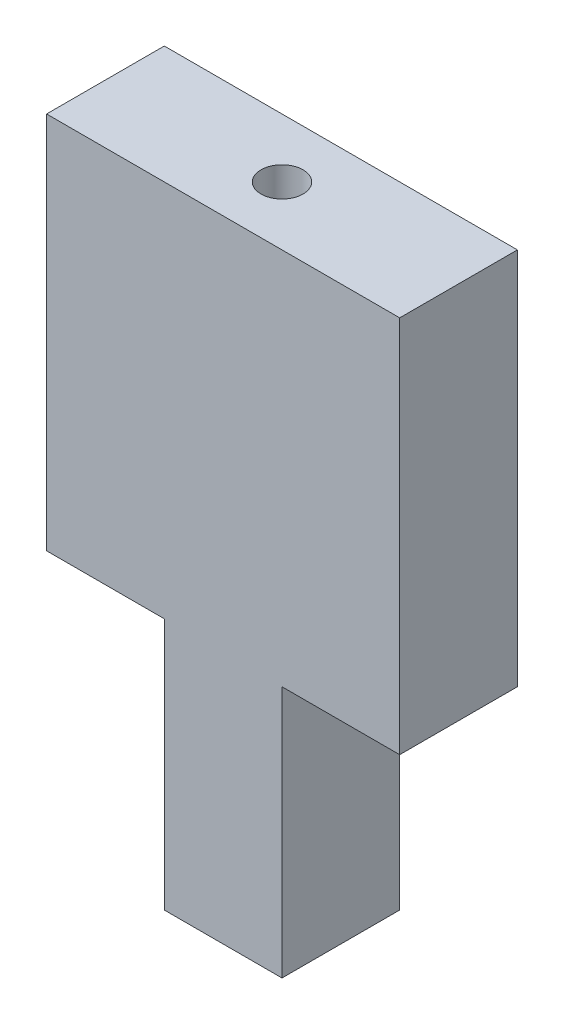
ISO-10303-21;
HEADER;
FILE_DESCRIPTION(('STEP AP214'),'2;1');
FILE_NAME('part.step','',(''),(''),'','','');
FILE_SCHEMA(('AUTOMOTIVE_DESIGN { 1 0 10303 214 1 1 1 1 }'));
ENDSEC;
DATA;
#1=APPLICATION_CONTEXT('core data for automotive mechanical design processes');
#2=APPLICATION_PROTOCOL_DEFINITION('international standard','automotive_design',2000,#1);
#3=PRODUCT_CONTEXT('',#1,'mechanical');
#4=PRODUCT('Part','Part','',(#3));
#5=PRODUCT_RELATED_PRODUCT_CATEGORY('part','',(#4));
#6=PRODUCT_DEFINITION_FORMATION('','',#4);
#7=PRODUCT_DEFINITION_CONTEXT('part definition',#1,'design');
#8=PRODUCT_DEFINITION('design','',#6,#7);
#9=PRODUCT_DEFINITION_SHAPE('','',#8);
#10=(LENGTH_UNIT() NAMED_UNIT(*) SI_UNIT(.MILLI.,.METRE.));
#11=(NAMED_UNIT(*) PLANE_ANGLE_UNIT() SI_UNIT($,.RADIAN.));
#12=(NAMED_UNIT(*) SI_UNIT($,.STERADIAN.) SOLID_ANGLE_UNIT());
#13=UNCERTAINTY_MEASURE_WITH_UNIT(LENGTH_MEASURE(1.E-05),#10,'distance_accuracy_value','');
#14=(GEOMETRIC_REPRESENTATION_CONTEXT(3) GLOBAL_UNCERTAINTY_ASSIGNED_CONTEXT((#13)) GLOBAL_UNIT_ASSIGNED_CONTEXT((#10,
#11,#12)) REPRESENTATION_CONTEXT('',''));
#15=CARTESIAN_POINT('',(0.,0.,0.));
#16=DIRECTION('',(0.,0.,1.));
#17=DIRECTION('',(1.,0.,0.));
#18=AXIS2_PLACEMENT_3D('',#15,#16,#17);
#19=CARTESIAN_POINT('',(-7.,75.,7.));
#20=DIRECTION('',(1.,0.,0.));
#21=DIRECTION('',(0.,0.,-1.));
#22=AXIS2_PLACEMENT_3D('',#19,#20,#21);
#23=PLANE('',#22);
#24=DIRECTION('',(0.,0.,1.));
#25=VECTOR('',#24,1.);
#26=CARTESIAN_POINT('',(-7.,30.,-6.99999999999999));
#27=LINE('',#26,#25);
#28=CARTESIAN_POINT('',(-7.,30.,-7.));
#29=VERTEX_POINT('',#28);
#30=CARTESIAN_POINT('',(-7.,30.,7.));
#31=VERTEX_POINT('',#30);
#32=EDGE_CURVE('E50',#29,#31,#27,.T.);
#33=ORIENTED_EDGE('',*,*,#32,.F.);
#34=DIRECTION('',(0.,-1.,0.));
#35=VECTOR('',#34,1.);
#36=CARTESIAN_POINT('',(-7.,75.,-7.));
#37=LINE('',#36,#35);
#38=CARTESIAN_POINT('',(-7.,0.,-7.));
#39=VERTEX_POINT('',#38);
#40=EDGE_CURVE('E43',#29,#39,#37,.T.);
#41=ORIENTED_EDGE('',*,*,#40,.T.);
#42=DIRECTION('',(0.,0.,1.));
#43=VECTOR('',#42,1.);
#44=CARTESIAN_POINT('',(-7.,0.,7.));
#45=LINE('',#44,#43);
#46=CARTESIAN_POINT('',(-7.,0.,7.));
#47=VERTEX_POINT('',#46);
#48=EDGE_CURVE('E160',#39,#47,#45,.T.);
#49=ORIENTED_EDGE('',*,*,#48,.T.);
#50=DIRECTION('',(0.,-1.,0.));
#51=VECTOR('',#50,1.);
#52=CARTESIAN_POINT('',(-7.,75.,7.));
#53=LINE('',#52,#51);
#54=EDGE_CURVE('E166',#31,#47,#53,.T.);
#55=ORIENTED_EDGE('',*,*,#54,.F.);
#56=EDGE_LOOP('',(#33,#41,#49,#55));
#57=FACE_BOUND('',#56,.T.);
#58=ADVANCED_FACE('F35',(#57),#23,.F.);
#59=CARTESIAN_POINT('',(7.,75.,7.));
#60=DIRECTION('',(-1.,0.,0.));
#61=DIRECTION('',(0.,0.,1.));
#62=AXIS2_PLACEMENT_3D('',#59,#60,#61);
#63=PLANE('',#62);
#64=DIRECTION('',(0.,0.,-1.));
#65=VECTOR('',#64,1.);
#66=CARTESIAN_POINT('',(7.,30.,6.99999999999999));
#67=LINE('',#66,#65);
#68=CARTESIAN_POINT('',(7.,30.,7.));
#69=VERTEX_POINT('',#68);
#70=CARTESIAN_POINT('',(7.,30.,-7.));
#71=VERTEX_POINT('',#70);
#72=EDGE_CURVE('E58',#69,#71,#67,.T.);
#73=ORIENTED_EDGE('',*,*,#72,.F.);
#74=DIRECTION('',(0.,-1.,0.));
#75=VECTOR('',#74,1.);
#76=CARTESIAN_POINT('',(7.,75.,7.));
#77=LINE('',#76,#75);
#78=CARTESIAN_POINT('',(7.,0.,7.));
#79=VERTEX_POINT('',#78);
#80=EDGE_CURVE('E155',#69,#79,#77,.T.);
#81=ORIENTED_EDGE('',*,*,#80,.T.);
#82=DIRECTION('',(0.,0.,-1.));
#83=VECTOR('',#82,1.);
#84=CARTESIAN_POINT('',(7.,0.,7.));
#85=LINE('',#84,#83);
#86=CARTESIAN_POINT('',(7.,0.,-7.));
#87=VERTEX_POINT('',#86);
#88=EDGE_CURVE('E147',#79,#87,#85,.T.);
#89=ORIENTED_EDGE('',*,*,#88,.T.);
#90=DIRECTION('',(0.,-1.,0.));
#91=VECTOR('',#90,1.);
#92=CARTESIAN_POINT('',(7.,75.,-7.));
#93=LINE('',#92,#91);
#94=EDGE_CURVE('E11',#71,#87,#93,.T.);
#95=ORIENTED_EDGE('',*,*,#94,.F.);
#96=EDGE_LOOP('',(#73,#81,#89,#95));
#97=FACE_BOUND('',#96,.T.);
#98=ADVANCED_FACE('F37',(#97),#63,.F.);
#99=CARTESIAN_POINT('',(-7.,75.,-7.));
#100=DIRECTION('',(0.,0.,1.));
#101=DIRECTION('',(1.,0.,0.));
#102=AXIS2_PLACEMENT_3D('',#99,#100,#101);
#103=PLANE('',#102);
#104=DIRECTION('',(-1.,0.,0.));
#105=VECTOR('',#104,1.);
#106=CARTESIAN_POINT('',(-7.,0.,-7.));
#107=LINE('',#106,#105);
#108=EDGE_CURVE('E158',#87,#39,#107,.T.);
#109=ORIENTED_EDGE('',*,*,#108,.T.);
#110=ORIENTED_EDGE('',*,*,#40,.F.);
#111=DIRECTION('',(1.,0.,0.));
#112=VECTOR('',#111,1.);
#113=CARTESIAN_POINT('',(-21.,30.,-6.99999999999999));
#114=LINE('',#113,#112);
#115=CARTESIAN_POINT('',(-21.,30.,-6.99999999999999));
#116=VERTEX_POINT('',#115);
#117=EDGE_CURVE('E103',#116,#29,#114,.T.);
#118=ORIENTED_EDGE('',*,*,#117,.F.);
#119=DIRECTION('',(0.,-1.,0.));
#120=VECTOR('',#119,1.);
#121=CARTESIAN_POINT('',(-21.,75.,-7.));
#122=LINE('',#121,#120);
#123=CARTESIAN_POINT('',(-21.,75.,-7.));
#124=VERTEX_POINT('',#123);
#125=EDGE_CURVE('E110',#124,#116,#122,.T.);
#126=ORIENTED_EDGE('',*,*,#125,.F.);
#127=DIRECTION('',(-1.,0.,0.));
#128=VECTOR('',#127,1.);
#129=CARTESIAN_POINT('',(-7.,75.,-7.));
#130=LINE('',#129,#128);
#131=CARTESIAN_POINT('',(21.,75.,-7.));
#132=VERTEX_POINT('',#131);
#133=EDGE_CURVE('E150',#132,#124,#130,.T.);
#134=ORIENTED_EDGE('',*,*,#133,.F.);
#135=DIRECTION('',(0.,1.,0.));
#136=VECTOR('',#135,1.);
#137=CARTESIAN_POINT('',(21.,75.,-7.));
#138=LINE('',#137,#136);
#139=CARTESIAN_POINT('',(21.,30.,-7.));
#140=VERTEX_POINT('',#139);
#141=EDGE_CURVE('E131',#140,#132,#138,.T.);
#142=ORIENTED_EDGE('',*,*,#141,.F.);
#143=DIRECTION('',(-1.,0.,0.));
#144=VECTOR('',#143,1.);
#145=CARTESIAN_POINT('',(21.,30.,-7.));
#146=LINE('',#145,#144);
#147=EDGE_CURVE('E136',#140,#71,#146,.T.);
#148=ORIENTED_EDGE('',*,*,#147,.T.);
#149=ORIENTED_EDGE('',*,*,#94,.T.);
#150=EDGE_LOOP('',(#109,#110,#118,#126,#134,#142,#148,#149));
#151=FACE_BOUND('',#150,.T.);
#152=ADVANCED_FACE('F120',(#151),#103,.F.);
#153=CARTESIAN_POINT('',(-7.,75.,7.));
#154=DIRECTION('',(0.,0.,-1.));
#155=DIRECTION('',(-1.,0.,0.));
#156=AXIS2_PLACEMENT_3D('',#153,#154,#155);
#157=PLANE('',#156);
#158=DIRECTION('',(1.,0.,0.));
#159=VECTOR('',#158,1.);
#160=CARTESIAN_POINT('',(-7.,0.,7.));
#161=LINE('',#160,#159);
#162=EDGE_CURVE('E153',#47,#79,#161,.T.);
#163=ORIENTED_EDGE('',*,*,#162,.T.);
#164=ORIENTED_EDGE('',*,*,#80,.F.);
#165=DIRECTION('',(-1.,0.,0.));
#166=VECTOR('',#165,1.);
#167=CARTESIAN_POINT('',(21.,30.,6.99999999999999));
#168=LINE('',#167,#166);
#169=CARTESIAN_POINT('',(21.,30.,6.99999999999999));
#170=VERTEX_POINT('',#169);
#171=EDGE_CURVE('E140',#170,#69,#168,.T.);
#172=ORIENTED_EDGE('',*,*,#171,.F.);
#173=DIRECTION('',(0.,-1.,0.));
#174=VECTOR('',#173,1.);
#175=CARTESIAN_POINT('',(21.,75.,7.));
#176=LINE('',#175,#174);
#177=CARTESIAN_POINT('',(21.,75.,7.));
#178=VERTEX_POINT('',#177);
#179=EDGE_CURVE('E122',#178,#170,#176,.T.);
#180=ORIENTED_EDGE('',*,*,#179,.F.);
#181=DIRECTION('',(1.,0.,0.));
#182=VECTOR('',#181,1.);
#183=CARTESIAN_POINT('',(-7.,75.,7.));
#184=LINE('',#183,#182);
#185=CARTESIAN_POINT('',(-21.,75.,7.));
#186=VERTEX_POINT('',#185);
#187=EDGE_CURVE('E152',#186,#178,#184,.T.);
#188=ORIENTED_EDGE('',*,*,#187,.F.);
#189=DIRECTION('',(0.,1.,0.));
#190=VECTOR('',#189,1.);
#191=CARTESIAN_POINT('',(-21.,75.,7.));
#192=LINE('',#191,#190);
#193=CARTESIAN_POINT('',(-21.,30.,7.));
#194=VERTEX_POINT('',#193);
#195=EDGE_CURVE('E109',#194,#186,#192,.T.);
#196=ORIENTED_EDGE('',*,*,#195,.F.);
#197=DIRECTION('',(1.,0.,0.));
#198=VECTOR('',#197,1.);
#199=CARTESIAN_POINT('',(-21.,30.,7.));
#200=LINE('',#199,#198);
#201=EDGE_CURVE('E105',#194,#31,#200,.T.);
#202=ORIENTED_EDGE('',*,*,#201,.T.);
#203=ORIENTED_EDGE('',*,*,#54,.T.);
#204=EDGE_LOOP('',(#163,#164,#172,#180,#188,#196,#202,#203));
#205=FACE_BOUND('',#204,.T.);
#206=ADVANCED_FACE('F174',(#205),#157,.F.);
#207=CARTESIAN_POINT('',(0.,75.,0.));
#208=DIRECTION('',(0.,-1.,0.));
#209=DIRECTION('',(0.,0.,-1.));
#210=AXIS2_PLACEMENT_3D('',#207,#208,#209);
#211=PLANE('',#210);
#212=CARTESIAN_POINT('',(0.,75.,0.));
#213=DIRECTION('',(0.,1.,0.));
#214=DIRECTION('',(0.,0.,1.));
#215=AXIS2_PLACEMENT_3D('',#212,#213,#214);
#216=CIRCLE('',#215,2.5);
#217=CARTESIAN_POINT('',(0.,75.,2.5));
#218=VERTEX_POINT('',#217);
#219=EDGE_CURVE('E143',#218,#218,#216,.T.);
#220=ORIENTED_EDGE('',*,*,#219,.F.);
#221=EDGE_LOOP('',(#220));
#222=FACE_BOUND('',#221,.T.);
#223=ORIENTED_EDGE('',*,*,#187,.T.);
#224=DIRECTION('',(0.,0.,1.));
#225=VECTOR('',#224,1.);
#226=CARTESIAN_POINT('',(21.,75.,7.));
#227=LINE('',#226,#225);
#228=EDGE_CURVE('E134',#132,#178,#227,.T.);
#229=ORIENTED_EDGE('',*,*,#228,.F.);
#230=ORIENTED_EDGE('',*,*,#133,.T.);
#231=DIRECTION('',(0.,0.,-1.));
#232=VECTOR('',#231,1.);
#233=CARTESIAN_POINT('',(-21.,75.,-7.));
#234=LINE('',#233,#232);
#235=EDGE_CURVE('E116',#186,#124,#234,.T.);
#236=ORIENTED_EDGE('',*,*,#235,.F.);
#237=EDGE_LOOP('',(#223,#229,#230,#236));
#238=FACE_BOUND('',#237,.T.);
#239=ADVANCED_FACE('F179',(#222,#238),#211,.F.);
#240=CARTESIAN_POINT('',(0.,0.,0.));
#241=DIRECTION('',(0.,-1.,0.));
#242=DIRECTION('',(0.,0.,-1.));
#243=AXIS2_PLACEMENT_3D('',#240,#241,#242);
#244=PLANE('',#243);
#245=ORIENTED_EDGE('',*,*,#88,.F.);
#246=ORIENTED_EDGE('',*,*,#162,.F.);
#247=ORIENTED_EDGE('',*,*,#48,.F.);
#248=ORIENTED_EDGE('',*,*,#108,.F.);
#249=EDGE_LOOP('',(#245,#246,#247,#248));
#250=FACE_BOUND('',#249,.T.);
#251=ADVANCED_FACE('F172',(#250),#244,.T.);
#252=CARTESIAN_POINT('',(0.,45.,0.));
#253=DIRECTION('',(0.,1.,0.));
#254=DIRECTION('',(0.,0.,1.));
#255=AXIS2_PLACEMENT_3D('',#252,#253,#254);
#256=CYLINDRICAL_SURFACE('',#255,2.5);
#257=CARTESIAN_POINT('',(0.,45.,0.));
#258=DIRECTION('',(0.,1.,0.));
#259=DIRECTION('',(0.,0.,1.));
#260=AXIS2_PLACEMENT_3D('',#257,#258,#259);
#261=CIRCLE('',#260,2.5);
#262=CARTESIAN_POINT('',(0.,45.,2.5));
#263=VERTEX_POINT('',#262);
#264=EDGE_CURVE('E144',#263,#263,#261,.T.);
#265=ORIENTED_EDGE('',*,*,#264,.F.);
#266=EDGE_LOOP('',(#265));
#267=FACE_BOUND('',#266,.T.);
#268=ORIENTED_EDGE('',*,*,#219,.T.);
#269=EDGE_LOOP('',(#268));
#270=FACE_BOUND('',#269,.T.);
#271=ADVANCED_FACE('F196',(#267,#270),#256,.F.);
#272=CARTESIAN_POINT('',(0.,45.,0.));
#273=DIRECTION('',(0.,1.,0.));
#274=DIRECTION('',(0.,0.,1.));
#275=AXIS2_PLACEMENT_3D('',#272,#273,#274);
#276=PLANE('',#275);
#277=ORIENTED_EDGE('',*,*,#264,.T.);
#278=EDGE_LOOP('',(#277));
#279=FACE_BOUND('',#278,.T.);
#280=ADVANCED_FACE('F189',(#279),#276,.T.);
#281=CARTESIAN_POINT('',(21.,30.,6.99999999999999));
#282=DIRECTION('',(0.,1.,0.));
#283=DIRECTION('',(0.,0.,1.));
#284=AXIS2_PLACEMENT_3D('',#281,#282,#283);
#285=PLANE('',#284);
#286=ORIENTED_EDGE('',*,*,#72,.T.);
#287=ORIENTED_EDGE('',*,*,#147,.F.);
#288=DIRECTION('',(0.,0.,-1.));
#289=VECTOR('',#288,1.);
#290=CARTESIAN_POINT('',(21.,30.,6.99999999999999));
#291=LINE('',#290,#289);
#292=EDGE_CURVE('E129',#170,#140,#291,.T.);
#293=ORIENTED_EDGE('',*,*,#292,.F.);
#294=ORIENTED_EDGE('',*,*,#171,.T.);
#295=EDGE_LOOP('',(#286,#287,#293,#294));
#296=FACE_BOUND('',#295,.T.);
#297=ADVANCED_FACE('F187',(#296),#285,.F.);
#298=CARTESIAN_POINT('',(21.,0.,0.));
#299=DIRECTION('',(1.,0.,0.));
#300=DIRECTION('',(0.,0.,-1.));
#301=AXIS2_PLACEMENT_3D('',#298,#299,#300);
#302=PLANE('',#301);
#303=ORIENTED_EDGE('',*,*,#179,.T.);
#304=ORIENTED_EDGE('',*,*,#292,.T.);
#305=ORIENTED_EDGE('',*,*,#141,.T.);
#306=ORIENTED_EDGE('',*,*,#228,.T.);
#307=EDGE_LOOP('',(#303,#304,#305,#306));
#308=FACE_BOUND('',#307,.T.);
#309=ADVANCED_FACE('F183',(#308),#302,.T.);
#310=CARTESIAN_POINT('',(-21.,30.,-6.99999999999999));
#311=DIRECTION('',(0.,1.,0.));
#312=DIRECTION('',(0.,0.,1.));
#313=AXIS2_PLACEMENT_3D('',#310,#311,#312);
#314=PLANE('',#313);
#315=ORIENTED_EDGE('',*,*,#32,.T.);
#316=ORIENTED_EDGE('',*,*,#201,.F.);
#317=DIRECTION('',(0.,0.,1.));
#318=VECTOR('',#317,1.);
#319=CARTESIAN_POINT('',(-21.,30.,-6.99999999999999));
#320=LINE('',#319,#318);
#321=EDGE_CURVE('E99',#116,#194,#320,.T.);
#322=ORIENTED_EDGE('',*,*,#321,.F.);
#323=ORIENTED_EDGE('',*,*,#117,.T.);
#324=EDGE_LOOP('',(#315,#316,#322,#323));
#325=FACE_BOUND('',#324,.T.);
#326=ADVANCED_FACE('F101',(#325),#314,.F.);
#327=CARTESIAN_POINT('',(-21.,0.,0.));
#328=DIRECTION('',(-1.,0.,0.));
#329=DIRECTION('',(0.,0.,1.));
#330=AXIS2_PLACEMENT_3D('',#327,#328,#329);
#331=PLANE('',#330);
#332=ORIENTED_EDGE('',*,*,#125,.T.);
#333=ORIENTED_EDGE('',*,*,#321,.T.);
#334=ORIENTED_EDGE('',*,*,#195,.T.);
#335=ORIENTED_EDGE('',*,*,#235,.T.);
#336=EDGE_LOOP('',(#332,#333,#334,#335));
#337=FACE_BOUND('',#336,.T.);
#338=ADVANCED_FACE('F114',(#337),#331,.T.);
#339=CLOSED_SHELL('',(#58,#98,#152,#206,#239,#251,#271,#280,#297,#309,#326,#338));
#340=MANIFOLD_SOLID_BREP('B2',#339);
#341=ADVANCED_BREP_SHAPE_REPRESENTATION('',(#18,#340),#14);
#342=SHAPE_DEFINITION_REPRESENTATION(#9,#341);
ENDSEC;
END-ISO-10303-21;
